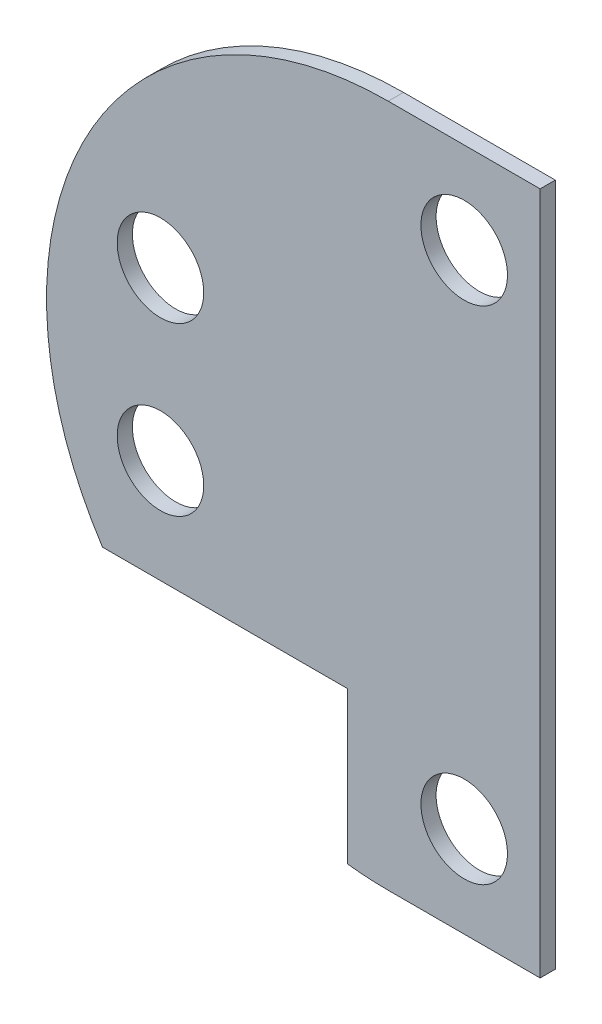
ISO-10303-21;
HEADER;
FILE_DESCRIPTION(('STEP AP214'),'2;1');
FILE_NAME('part.step','',(''),(''),'','','');
FILE_SCHEMA(('AUTOMOTIVE_DESIGN { 1 0 10303 214 1 1 1 1 }'));
ENDSEC;
DATA;
#1=APPLICATION_CONTEXT('core data for automotive mechanical design processes');
#2=APPLICATION_PROTOCOL_DEFINITION('international standard','automotive_design',2000,#1);
#3=PRODUCT_CONTEXT('',#1,'mechanical');
#4=PRODUCT('Part','Part','',(#3));
#5=PRODUCT_RELATED_PRODUCT_CATEGORY('part','',(#4));
#6=PRODUCT_DEFINITION_FORMATION('','',#4);
#7=PRODUCT_DEFINITION_CONTEXT('part definition',#1,'design');
#8=PRODUCT_DEFINITION('design','',#6,#7);
#9=PRODUCT_DEFINITION_SHAPE('','',#8);
#10=(LENGTH_UNIT() NAMED_UNIT(*) SI_UNIT(.MILLI.,.METRE.));
#11=(NAMED_UNIT(*) PLANE_ANGLE_UNIT() SI_UNIT($,.RADIAN.));
#12=(NAMED_UNIT(*) SI_UNIT($,.STERADIAN.) SOLID_ANGLE_UNIT());
#13=UNCERTAINTY_MEASURE_WITH_UNIT(LENGTH_MEASURE(1.E-05),#10,'distance_accuracy_value','');
#14=(GEOMETRIC_REPRESENTATION_CONTEXT(3) GLOBAL_UNCERTAINTY_ASSIGNED_CONTEXT((#13)) GLOBAL_UNIT_ASSIGNED_CONTEXT((#10,
#11,#12)) REPRESENTATION_CONTEXT('',''));
#15=CARTESIAN_POINT('',(0.,0.,0.));
#16=DIRECTION('',(0.,0.,1.));
#17=DIRECTION('',(1.,0.,0.));
#18=AXIS2_PLACEMENT_3D('',#15,#16,#17);
#19=CARTESIAN_POINT('',(-5.,0.,1.));
#20=DIRECTION('',(0.,0.,-1.));
#21=DIRECTION('',(-1.,0.,0.));
#22=AXIS2_PLACEMENT_3D('',#19,#20,#21);
#23=CYLINDRICAL_SURFACE('',#22,22.5);
#24=DIRECTION('',(0.,0.,-1.));
#25=VECTOR('',#24,1.);
#26=CARTESIAN_POINT('',(-23.8142073976025,-12.34,1.));
#27=LINE('',#26,#25);
#28=CARTESIAN_POINT('',(-23.8142073976025,-12.34,1.));
#29=VERTEX_POINT('',#28);
#30=CARTESIAN_POINT('',(-23.8142073976025,-12.34,0.));
#31=VERTEX_POINT('',#30);
#32=EDGE_CURVE('E111',#29,#31,#27,.T.);
#33=ORIENTED_EDGE('',*,*,#32,.F.);
#34=CARTESIAN_POINT('',(-5.,0.,1.));
#35=DIRECTION('',(0.,0.,1.));
#36=DIRECTION('',(-1.,0.,0.));
#37=AXIS2_PLACEMENT_3D('',#34,#35,#36);
#38=CIRCLE('',#37,22.5);
#39=CARTESIAN_POINT('',(-5.,22.5,1.));
#40=VERTEX_POINT('',#39);
#41=EDGE_CURVE('E122',#40,#29,#38,.T.);
#42=ORIENTED_EDGE('',*,*,#41,.F.);
#43=DIRECTION('',(0.,0.,-1.));
#44=VECTOR('',#43,1.);
#45=CARTESIAN_POINT('',(-5.,22.5,1.));
#46=LINE('',#45,#44);
#47=CARTESIAN_POINT('',(-5.,22.5,0.));
#48=VERTEX_POINT('',#47);
#49=EDGE_CURVE('E42',#40,#48,#46,.T.);
#50=ORIENTED_EDGE('',*,*,#49,.T.);
#51=CARTESIAN_POINT('',(-5.,0.,0.));
#52=DIRECTION('',(0.,0.,1.));
#53=DIRECTION('',(-1.,0.,0.));
#54=AXIS2_PLACEMENT_3D('',#51,#52,#53);
#55=CIRCLE('',#54,22.5);
#56=EDGE_CURVE('E137',#48,#31,#55,.T.);
#57=ORIENTED_EDGE('',*,*,#56,.T.);
#58=EDGE_LOOP('',(#33,#42,#50,#57));
#59=FACE_BOUND('',#58,.T.);
#60=ADVANCED_FACE('F34',(#59),#23,.T.);
#61=CARTESIAN_POINT('',(-5.,0.,1.));
#62=DIRECTION('',(0.,0.,-1.));
#63=DIRECTION('',(-1.,0.,0.));
#64=AXIS2_PLACEMENT_3D('',#61,#62,#63);
#65=PLANE('',#64);
#66=DIRECTION('',(-1.,0.,0.));
#67=VECTOR('',#66,1.);
#68=CARTESIAN_POINT('',(-7.7,-12.34,1.));
#69=LINE('',#68,#67);
#70=CARTESIAN_POINT('',(-7.7,-12.34,1.));
#71=VERTEX_POINT('',#70);
#72=EDGE_CURVE('E49',#71,#29,#69,.T.);
#73=ORIENTED_EDGE('',*,*,#72,.F.);
#74=DIRECTION('',(0.,-1.,0.));
#75=VECTOR('',#74,1.);
#76=CARTESIAN_POINT('',(-7.7,-12.34,1.));
#77=LINE('',#76,#75);
#78=CARTESIAN_POINT('',(-7.69999999999999,-22.3374125627835,1.));
#79=VERTEX_POINT('',#78);
#80=EDGE_CURVE('E105',#71,#79,#77,.T.);
#81=ORIENTED_EDGE('',*,*,#80,.T.);
#82=CARTESIAN_POINT('',(-5.,-22.5,1.));
#83=VERTEX_POINT('',#82);
#84=EDGE_CURVE('E115',#79,#83,#38,.T.);
#85=ORIENTED_EDGE('',*,*,#84,.T.);
#86=DIRECTION('',(1.,0.,0.));
#87=VECTOR('',#86,1.);
#88=CARTESIAN_POINT('',(-5.,-22.5,1.));
#89=LINE('',#88,#87);
#90=CARTESIAN_POINT('',(5.,-22.5,1.));
#91=VERTEX_POINT('',#90);
#92=EDGE_CURVE('E58',#83,#91,#89,.T.);
#93=ORIENTED_EDGE('',*,*,#92,.T.);
#94=DIRECTION('',(0.,1.,0.));
#95=VECTOR('',#94,1.);
#96=CARTESIAN_POINT('',(5.,-22.5,1.));
#97=LINE('',#96,#95);
#98=CARTESIAN_POINT('',(5.,22.5,1.));
#99=VERTEX_POINT('',#98);
#100=EDGE_CURVE('E124',#91,#99,#97,.T.);
#101=ORIENTED_EDGE('',*,*,#100,.T.);
#102=DIRECTION('',(-1.,0.,0.));
#103=VECTOR('',#102,1.);
#104=CARTESIAN_POINT('',(-5.,22.5,1.));
#105=LINE('',#104,#103);
#106=EDGE_CURVE('E86',#99,#40,#105,.T.);
#107=ORIENTED_EDGE('',*,*,#106,.T.);
#108=ORIENTED_EDGE('',*,*,#41,.T.);
#109=EDGE_LOOP('',(#73,#81,#85,#93,#101,#107,#108));
#110=FACE_BOUND('',#109,.T.);
#111=CARTESIAN_POINT('',(0.,16.5,1.));
#112=DIRECTION('',(0.,0.,1.));
#113=DIRECTION('',(1.,0.,0.));
#114=AXIS2_PLACEMENT_3D('',#111,#112,#113);
#115=CIRCLE('',#114,2.85);
#116=CARTESIAN_POINT('',(2.85,16.5,1.));
#117=VERTEX_POINT('',#116);
#118=EDGE_CURVE('E134',#117,#117,#115,.T.);
#119=ORIENTED_EDGE('',*,*,#118,.F.);
#120=EDGE_LOOP('',(#119));
#121=FACE_BOUND('',#120,.T.);
#122=CARTESIAN_POINT('',(0.,-16.5,1.));
#123=DIRECTION('',(0.,0.,1.));
#124=DIRECTION('',(1.,0.,0.));
#125=AXIS2_PLACEMENT_3D('',#122,#123,#124);
#126=CIRCLE('',#125,2.85);
#127=CARTESIAN_POINT('',(2.85,-16.5,1.));
#128=VERTEX_POINT('',#127);
#129=EDGE_CURVE('E172',#128,#128,#126,.T.);
#130=ORIENTED_EDGE('',*,*,#129,.F.);
#131=EDGE_LOOP('',(#130));
#132=FACE_BOUND('',#131,.T.);
#133=CARTESIAN_POINT('',(-20.,-5.5,1.));
#134=DIRECTION('',(0.,0.,1.));
#135=DIRECTION('',(1.,0.,0.));
#136=AXIS2_PLACEMENT_3D('',#133,#134,#135);
#137=CIRCLE('',#136,2.85);
#138=CARTESIAN_POINT('',(-17.15,-5.5,1.));
#139=VERTEX_POINT('',#138);
#140=EDGE_CURVE('E166',#139,#139,#137,.T.);
#141=ORIENTED_EDGE('',*,*,#140,.F.);
#142=EDGE_LOOP('',(#141));
#143=FACE_BOUND('',#142,.T.);
#144=CARTESIAN_POINT('',(-20.,5.5,1.));
#145=DIRECTION('',(0.,0.,1.));
#146=DIRECTION('',(1.,0.,0.));
#147=AXIS2_PLACEMENT_3D('',#144,#145,#146);
#148=CIRCLE('',#147,2.85);
#149=CARTESIAN_POINT('',(-17.15,5.5,1.));
#150=VERTEX_POINT('',#149);
#151=EDGE_CURVE('E160',#150,#150,#148,.T.);
#152=ORIENTED_EDGE('',*,*,#151,.F.);
#153=EDGE_LOOP('',(#152));
#154=FACE_BOUND('',#153,.T.);
#155=ADVANCED_FACE('F113',(#110,#121,#132,#143,#154),#65,.F.);
#156=CARTESIAN_POINT('',(-5.,0.,0.));
#157=DIRECTION('',(0.,0.,-1.));
#158=DIRECTION('',(-1.,0.,0.));
#159=AXIS2_PLACEMENT_3D('',#156,#157,#158);
#160=PLANE('',#159);
#161=DIRECTION('',(0.,-1.,0.));
#162=VECTOR('',#161,1.);
#163=CARTESIAN_POINT('',(-7.7,-12.34,0.));
#164=LINE('',#163,#162);
#165=CARTESIAN_POINT('',(-7.7,-12.34,0.));
#166=VERTEX_POINT('',#165);
#167=CARTESIAN_POINT('',(-7.69999999999999,-22.3374125627835,0.));
#168=VERTEX_POINT('',#167);
#169=EDGE_CURVE('E107',#166,#168,#164,.T.);
#170=ORIENTED_EDGE('',*,*,#169,.F.);
#171=DIRECTION('',(-1.,0.,0.));
#172=VECTOR('',#171,1.);
#173=CARTESIAN_POINT('',(-7.7,-12.34,0.));
#174=LINE('',#173,#172);
#175=EDGE_CURVE('E118',#166,#31,#174,.T.);
#176=ORIENTED_EDGE('',*,*,#175,.T.);
#177=ORIENTED_EDGE('',*,*,#56,.F.);
#178=DIRECTION('',(-1.,0.,0.));
#179=VECTOR('',#178,1.);
#180=CARTESIAN_POINT('',(-5.,22.5,0.));
#181=LINE('',#180,#179);
#182=CARTESIAN_POINT('',(5.,22.5,0.));
#183=VERTEX_POINT('',#182);
#184=EDGE_CURVE('E133',#183,#48,#181,.T.);
#185=ORIENTED_EDGE('',*,*,#184,.F.);
#186=DIRECTION('',(0.,1.,0.));
#187=VECTOR('',#186,1.);
#188=CARTESIAN_POINT('',(5.,-22.5,0.));
#189=LINE('',#188,#187);
#190=CARTESIAN_POINT('',(5.,-22.5,0.));
#191=VERTEX_POINT('',#190);
#192=EDGE_CURVE('E130',#191,#183,#189,.T.);
#193=ORIENTED_EDGE('',*,*,#192,.F.);
#194=DIRECTION('',(1.,0.,0.));
#195=VECTOR('',#194,1.);
#196=CARTESIAN_POINT('',(-5.,-22.5,0.));
#197=LINE('',#196,#195);
#198=CARTESIAN_POINT('',(-5.,-22.5,0.));
#199=VERTEX_POINT('',#198);
#200=EDGE_CURVE('E79',#199,#191,#197,.T.);
#201=ORIENTED_EDGE('',*,*,#200,.F.);
#202=EDGE_CURVE('E136',#168,#199,#55,.T.);
#203=ORIENTED_EDGE('',*,*,#202,.F.);
#204=EDGE_LOOP('',(#170,#176,#177,#185,#193,#201,#203));
#205=FACE_BOUND('',#204,.T.);
#206=CARTESIAN_POINT('',(-20.,-5.5,0.));
#207=DIRECTION('',(0.,0.,1.));
#208=DIRECTION('',(1.,0.,0.));
#209=AXIS2_PLACEMENT_3D('',#206,#207,#208);
#210=CIRCLE('',#209,2.85);
#211=CARTESIAN_POINT('',(-17.15,-5.5,0.));
#212=VERTEX_POINT('',#211);
#213=EDGE_CURVE('E163',#212,#212,#210,.T.);
#214=ORIENTED_EDGE('',*,*,#213,.T.);
#215=EDGE_LOOP('',(#214));
#216=FACE_BOUND('',#215,.T.);
#217=CARTESIAN_POINT('',(0.,16.5,0.));
#218=DIRECTION('',(0.,0.,1.));
#219=DIRECTION('',(1.,0.,0.));
#220=AXIS2_PLACEMENT_3D('',#217,#218,#219);
#221=CIRCLE('',#220,2.85);
#222=CARTESIAN_POINT('',(2.85,16.5,0.));
#223=VERTEX_POINT('',#222);
#224=EDGE_CURVE('E175',#223,#223,#221,.T.);
#225=ORIENTED_EDGE('',*,*,#224,.T.);
#226=EDGE_LOOP('',(#225));
#227=FACE_BOUND('',#226,.T.);
#228=CARTESIAN_POINT('',(0.,-16.5,0.));
#229=DIRECTION('',(0.,0.,1.));
#230=DIRECTION('',(1.,0.,0.));
#231=AXIS2_PLACEMENT_3D('',#228,#229,#230);
#232=CIRCLE('',#231,2.85);
#233=CARTESIAN_POINT('',(2.85,-16.5,0.));
#234=VERTEX_POINT('',#233);
#235=EDGE_CURVE('E169',#234,#234,#232,.T.);
#236=ORIENTED_EDGE('',*,*,#235,.T.);
#237=EDGE_LOOP('',(#236));
#238=FACE_BOUND('',#237,.T.);
#239=CARTESIAN_POINT('',(-20.,5.5,0.));
#240=DIRECTION('',(0.,0.,1.));
#241=DIRECTION('',(1.,0.,0.));
#242=AXIS2_PLACEMENT_3D('',#239,#240,#241);
#243=CIRCLE('',#242,2.85);
#244=CARTESIAN_POINT('',(-17.15,5.5,0.));
#245=VERTEX_POINT('',#244);
#246=EDGE_CURVE('E158',#245,#245,#243,.T.);
#247=ORIENTED_EDGE('',*,*,#246,.T.);
#248=EDGE_LOOP('',(#247));
#249=FACE_BOUND('',#248,.T.);
#250=ADVANCED_FACE('F148',(#205,#216,#227,#238,#249),#160,.T.);
#251=CARTESIAN_POINT('',(5.,-22.5,1.));
#252=DIRECTION('',(-1.,0.,0.));
#253=DIRECTION('',(0.,-1.,0.));
#254=AXIS2_PLACEMENT_3D('',#251,#252,#253);
#255=PLANE('',#254);
#256=ORIENTED_EDGE('',*,*,#192,.T.);
#257=DIRECTION('',(0.,0.,-1.));
#258=VECTOR('',#257,1.);
#259=CARTESIAN_POINT('',(5.,22.5,1.));
#260=LINE('',#259,#258);
#261=EDGE_CURVE('E11',#99,#183,#260,.T.);
#262=ORIENTED_EDGE('',*,*,#261,.F.);
#263=ORIENTED_EDGE('',*,*,#100,.F.);
#264=DIRECTION('',(0.,0.,-1.));
#265=VECTOR('',#264,1.);
#266=CARTESIAN_POINT('',(5.,-22.5,1.));
#267=LINE('',#266,#265);
#268=EDGE_CURVE('E129',#91,#191,#267,.T.);
#269=ORIENTED_EDGE('',*,*,#268,.T.);
#270=EDGE_LOOP('',(#256,#262,#263,#269));
#271=FACE_BOUND('',#270,.T.);
#272=ADVANCED_FACE('F36',(#271),#255,.F.);
#273=CARTESIAN_POINT('',(-5.,22.5,1.));
#274=DIRECTION('',(0.,-1.,0.));
#275=DIRECTION('',(0.,0.,-1.));
#276=AXIS2_PLACEMENT_3D('',#273,#274,#275);
#277=PLANE('',#276);
#278=ORIENTED_EDGE('',*,*,#184,.T.);
#279=ORIENTED_EDGE('',*,*,#49,.F.);
#280=ORIENTED_EDGE('',*,*,#106,.F.);
#281=ORIENTED_EDGE('',*,*,#261,.T.);
#282=EDGE_LOOP('',(#278,#279,#280,#281));
#283=FACE_BOUND('',#282,.T.);
#284=ADVANCED_FACE('F184',(#283),#277,.F.);
#285=ORIENTED_EDGE('',*,*,#84,.F.);
#286=DIRECTION('',(0.,0.,-1.));
#287=VECTOR('',#286,1.);
#288=CARTESIAN_POINT('',(-7.69999999999999,-22.3374125627835,1.));
#289=LINE('',#288,#287);
#290=EDGE_CURVE('E102',#79,#168,#289,.T.);
#291=ORIENTED_EDGE('',*,*,#290,.T.);
#292=ORIENTED_EDGE('',*,*,#202,.T.);
#293=DIRECTION('',(0.,0.,-1.));
#294=VECTOR('',#293,1.);
#295=CARTESIAN_POINT('',(-5.,-22.5,1.));
#296=LINE('',#295,#294);
#297=EDGE_CURVE('E121',#83,#199,#296,.T.);
#298=ORIENTED_EDGE('',*,*,#297,.F.);
#299=EDGE_LOOP('',(#285,#291,#292,#298));
#300=FACE_BOUND('',#299,.T.);
#301=ADVANCED_FACE('F120',(#300),#23,.T.);
#302=CARTESIAN_POINT('',(-5.,-22.5,1.));
#303=DIRECTION('',(0.,1.,0.));
#304=DIRECTION('',(0.,0.,1.));
#305=AXIS2_PLACEMENT_3D('',#302,#303,#304);
#306=PLANE('',#305);
#307=ORIENTED_EDGE('',*,*,#200,.T.);
#308=ORIENTED_EDGE('',*,*,#268,.F.);
#309=ORIENTED_EDGE('',*,*,#92,.F.);
#310=ORIENTED_EDGE('',*,*,#297,.T.);
#311=EDGE_LOOP('',(#307,#308,#309,#310));
#312=FACE_BOUND('',#311,.T.);
#313=ADVANCED_FACE('F190',(#312),#306,.F.);
#314=CARTESIAN_POINT('',(0.,16.5,1.));
#315=DIRECTION('',(0.,0.,-1.));
#316=DIRECTION('',(-1.,0.,0.));
#317=AXIS2_PLACEMENT_3D('',#314,#315,#316);
#318=CYLINDRICAL_SURFACE('',#317,2.85);
#319=ORIENTED_EDGE('',*,*,#118,.T.);
#320=EDGE_LOOP('',(#319));
#321=FACE_BOUND('',#320,.T.);
#322=ORIENTED_EDGE('',*,*,#224,.F.);
#323=EDGE_LOOP('',(#322));
#324=FACE_BOUND('',#323,.T.);
#325=ADVANCED_FACE('F200',(#321,#324),#318,.F.);
#326=CARTESIAN_POINT('',(0.,-16.5,1.));
#327=DIRECTION('',(0.,0.,-1.));
#328=DIRECTION('',(-1.,0.,0.));
#329=AXIS2_PLACEMENT_3D('',#326,#327,#328);
#330=CYLINDRICAL_SURFACE('',#329,2.85);
#331=ORIENTED_EDGE('',*,*,#129,.T.);
#332=EDGE_LOOP('',(#331));
#333=FACE_BOUND('',#332,.T.);
#334=ORIENTED_EDGE('',*,*,#235,.F.);
#335=EDGE_LOOP('',(#334));
#336=FACE_BOUND('',#335,.T.);
#337=ADVANCED_FACE('F205',(#333,#336),#330,.F.);
#338=CARTESIAN_POINT('',(-20.,-5.5,1.));
#339=DIRECTION('',(0.,0.,-1.));
#340=DIRECTION('',(-1.,0.,0.));
#341=AXIS2_PLACEMENT_3D('',#338,#339,#340);
#342=CYLINDRICAL_SURFACE('',#341,2.85);
#343=ORIENTED_EDGE('',*,*,#140,.T.);
#344=EDGE_LOOP('',(#343));
#345=FACE_BOUND('',#344,.T.);
#346=ORIENTED_EDGE('',*,*,#213,.F.);
#347=EDGE_LOOP('',(#346));
#348=FACE_BOUND('',#347,.T.);
#349=ADVANCED_FACE('F209',(#345,#348),#342,.F.);
#350=CARTESIAN_POINT('',(-20.,5.5,1.));
#351=DIRECTION('',(0.,0.,-1.));
#352=DIRECTION('',(-1.,0.,0.));
#353=AXIS2_PLACEMENT_3D('',#350,#351,#352);
#354=CYLINDRICAL_SURFACE('',#353,2.85);
#355=ORIENTED_EDGE('',*,*,#151,.T.);
#356=EDGE_LOOP('',(#355));
#357=FACE_BOUND('',#356,.T.);
#358=ORIENTED_EDGE('',*,*,#246,.F.);
#359=EDGE_LOOP('',(#358));
#360=FACE_BOUND('',#359,.T.);
#361=ADVANCED_FACE('F213',(#357,#360),#354,.F.);
#362=CARTESIAN_POINT('',(-7.7,-12.34,1.));
#363=DIRECTION('',(1.,0.,0.));
#364=DIRECTION('',(0.,1.,0.));
#365=AXIS2_PLACEMENT_3D('',#362,#363,#364);
#366=PLANE('',#365);
#367=ORIENTED_EDGE('',*,*,#169,.T.);
#368=ORIENTED_EDGE('',*,*,#290,.F.);
#369=ORIENTED_EDGE('',*,*,#80,.F.);
#370=DIRECTION('',(0.,0.,-1.));
#371=VECTOR('',#370,1.);
#372=CARTESIAN_POINT('',(-7.7,-12.34,1.));
#373=LINE('',#372,#371);
#374=EDGE_CURVE('E156',#71,#166,#373,.T.);
#375=ORIENTED_EDGE('',*,*,#374,.T.);
#376=EDGE_LOOP('',(#367,#368,#369,#375));
#377=FACE_BOUND('',#376,.T.);
#378=ADVANCED_FACE('F104',(#377),#366,.F.);
#379=CARTESIAN_POINT('',(-7.7,-12.34,1.));
#380=DIRECTION('',(0.,-1.,0.));
#381=DIRECTION('',(0.,0.,-1.));
#382=AXIS2_PLACEMENT_3D('',#379,#380,#381);
#383=PLANE('',#382);
#384=ORIENTED_EDGE('',*,*,#175,.F.);
#385=ORIENTED_EDGE('',*,*,#374,.F.);
#386=ORIENTED_EDGE('',*,*,#72,.T.);
#387=ORIENTED_EDGE('',*,*,#32,.T.);
#388=EDGE_LOOP('',(#384,#385,#386,#387));
#389=FACE_BOUND('',#388,.T.);
#390=ADVANCED_FACE('F220',(#389),#383,.T.);
#391=CLOSED_SHELL('',(#60,#155,#250,#272,#284,#301,#313,#325,#337,#349,#361,#378,#390));
#392=MANIFOLD_SOLID_BREP('B2',#391);
#393=ADVANCED_BREP_SHAPE_REPRESENTATION('',(#18,#392),#14);
#394=SHAPE_DEFINITION_REPRESENTATION(#9,#393);
ENDSEC;
END-ISO-10303-21;
